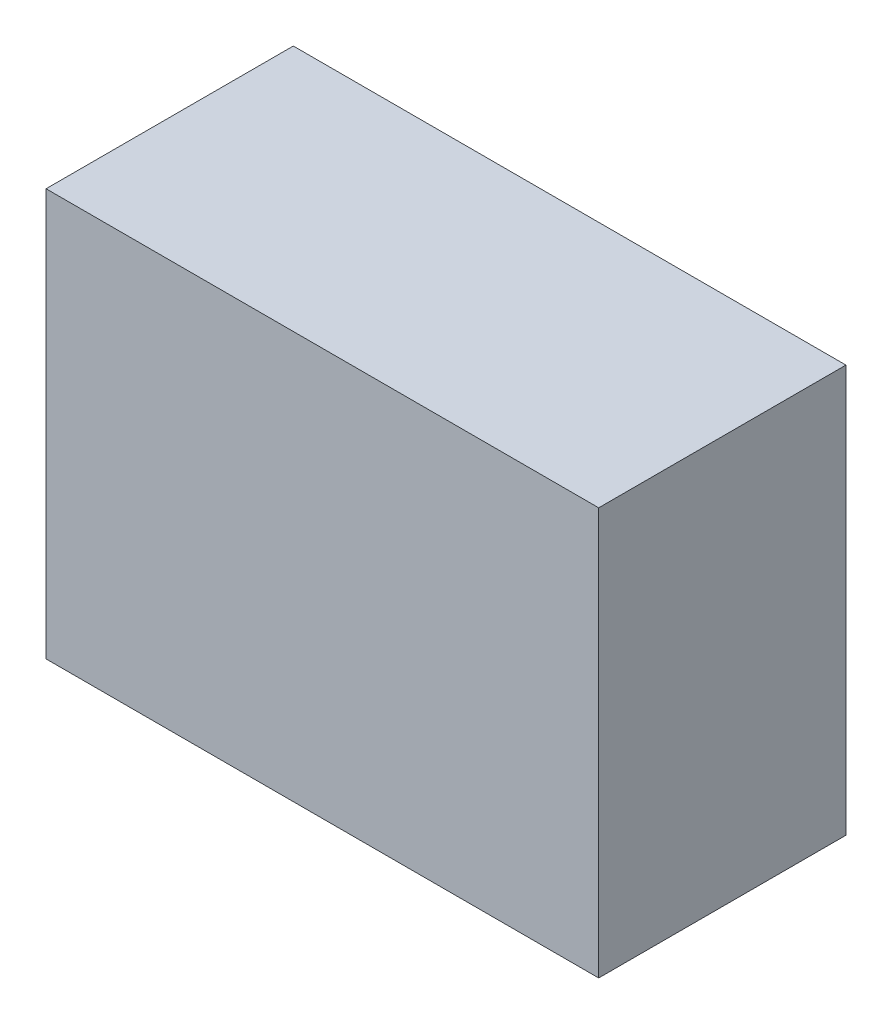
ISO-10303-21;
HEADER;
FILE_DESCRIPTION(('STEP AP214'),'2;1');
FILE_NAME('part.step','',(''),(''),'','','');
FILE_SCHEMA(('AUTOMOTIVE_DESIGN { 1 0 10303 214 1 1 1 1 }'));
ENDSEC;
DATA;
#1=APPLICATION_CONTEXT('core data for automotive mechanical design processes');
#2=APPLICATION_PROTOCOL_DEFINITION('international standard','automotive_design',2000,#1);
#3=PRODUCT_CONTEXT('',#1,'mechanical');
#4=PRODUCT('Part','Part','',(#3));
#5=PRODUCT_RELATED_PRODUCT_CATEGORY('part','',(#4));
#6=PRODUCT_DEFINITION_FORMATION('','',#4);
#7=PRODUCT_DEFINITION_CONTEXT('part definition',#1,'design');
#8=PRODUCT_DEFINITION('design','',#6,#7);
#9=PRODUCT_DEFINITION_SHAPE('','',#8);
#10=(LENGTH_UNIT() NAMED_UNIT(*) SI_UNIT(.MILLI.,.METRE.));
#11=(NAMED_UNIT(*) PLANE_ANGLE_UNIT() SI_UNIT($,.RADIAN.));
#12=(NAMED_UNIT(*) SI_UNIT($,.STERADIAN.) SOLID_ANGLE_UNIT());
#13=UNCERTAINTY_MEASURE_WITH_UNIT(LENGTH_MEASURE(1.E-05),#10,'distance_accuracy_value','');
#14=(GEOMETRIC_REPRESENTATION_CONTEXT(3) GLOBAL_UNCERTAINTY_ASSIGNED_CONTEXT((#13)) GLOBAL_UNIT_ASSIGNED_CONTEXT((#10,
#11,#12)) REPRESENTATION_CONTEXT('',''));
#15=CARTESIAN_POINT('',(0.,0.,0.));
#16=DIRECTION('',(0.,0.,1.));
#17=DIRECTION('',(1.,0.,0.));
#18=AXIS2_PLACEMENT_3D('',#15,#16,#17);
#19=CARTESIAN_POINT('',(-1.9,1.4,1.7));
#20=DIRECTION('',(1.,0.,0.));
#21=DIRECTION('',(0.,1.,0.));
#22=AXIS2_PLACEMENT_3D('',#19,#20,#21);
#23=PLANE('',#22);
#24=DIRECTION('',(0.,-1.,0.));
#25=VECTOR('',#24,1.);
#26=CARTESIAN_POINT('',(-1.9,1.4,0.));
#27=LINE('',#26,#25);
#28=CARTESIAN_POINT('',(-1.9,1.4,0.));
#29=VERTEX_POINT('',#28);
#30=CARTESIAN_POINT('',(-1.9,-1.4,0.));
#31=VERTEX_POINT('',#30);
#32=EDGE_CURVE('E104',#29,#31,#27,.T.);
#33=ORIENTED_EDGE('',*,*,#32,.T.);
#34=DIRECTION('',(0.,0.,-1.));
#35=VECTOR('',#34,1.);
#36=CARTESIAN_POINT('',(-1.9,-1.4,1.7));
#37=LINE('',#36,#35);
#38=CARTESIAN_POINT('',(-1.9,-1.4,1.7));
#39=VERTEX_POINT('',#38);
#40=EDGE_CURVE('E11',#39,#31,#37,.T.);
#41=ORIENTED_EDGE('',*,*,#40,.F.);
#42=DIRECTION('',(0.,-1.,0.));
#43=VECTOR('',#42,1.);
#44=CARTESIAN_POINT('',(-1.9,1.4,1.7));
#45=LINE('',#44,#43);
#46=CARTESIAN_POINT('',(-1.9,1.4,1.7));
#47=VERTEX_POINT('',#46);
#48=EDGE_CURVE('E92',#47,#39,#45,.T.);
#49=ORIENTED_EDGE('',*,*,#48,.F.);
#50=DIRECTION('',(0.,0.,-1.));
#51=VECTOR('',#50,1.);
#52=CARTESIAN_POINT('',(-1.9,1.4,1.7));
#53=LINE('',#52,#51);
#54=EDGE_CURVE('E100',#47,#29,#53,.T.);
#55=ORIENTED_EDGE('',*,*,#54,.T.);
#56=EDGE_LOOP('',(#33,#41,#49,#55));
#57=FACE_BOUND('',#56,.T.);
#58=ADVANCED_FACE('F41',(#57),#23,.F.);
#59=CARTESIAN_POINT('',(-1.9,-1.4,1.7));
#60=DIRECTION('',(0.,1.,0.));
#61=DIRECTION('',(0.,0.,1.));
#62=AXIS2_PLACEMENT_3D('',#59,#60,#61);
#63=PLANE('',#62);
#64=DIRECTION('',(1.,0.,0.));
#65=VECTOR('',#64,1.);
#66=CARTESIAN_POINT('',(-1.9,-1.4,0.));
#67=LINE('',#66,#65);
#68=CARTESIAN_POINT('',(1.9,-1.4,0.));
#69=VERTEX_POINT('',#68);
#70=EDGE_CURVE('E96',#31,#69,#67,.T.);
#71=ORIENTED_EDGE('',*,*,#70,.T.);
#72=DIRECTION('',(0.,0.,-1.));
#73=VECTOR('',#72,1.);
#74=CARTESIAN_POINT('',(1.9,-1.4,1.7));
#75=LINE('',#74,#73);
#76=CARTESIAN_POINT('',(1.9,-1.4,1.7));
#77=VERTEX_POINT('',#76);
#78=EDGE_CURVE('E49',#77,#69,#75,.T.);
#79=ORIENTED_EDGE('',*,*,#78,.F.);
#80=DIRECTION('',(1.,0.,0.));
#81=VECTOR('',#80,1.);
#82=CARTESIAN_POINT('',(-1.9,-1.4,1.7));
#83=LINE('',#82,#81);
#84=EDGE_CURVE('E87',#39,#77,#83,.T.);
#85=ORIENTED_EDGE('',*,*,#84,.F.);
#86=ORIENTED_EDGE('',*,*,#40,.T.);
#87=EDGE_LOOP('',(#71,#79,#85,#86));
#88=FACE_BOUND('',#87,.T.);
#89=ADVANCED_FACE('F95',(#88),#63,.F.);
#90=CARTESIAN_POINT('',(1.9,1.4,1.7));
#91=DIRECTION('',(-1.,0.,0.));
#92=DIRECTION('',(0.,-1.,0.));
#93=AXIS2_PLACEMENT_3D('',#90,#91,#92);
#94=PLANE('',#93);
#95=DIRECTION('',(0.,1.,0.));
#96=VECTOR('',#95,1.);
#97=CARTESIAN_POINT('',(1.9,1.4,0.));
#98=LINE('',#97,#96);
#99=CARTESIAN_POINT('',(1.9,1.4,0.));
#100=VERTEX_POINT('',#99);
#101=EDGE_CURVE('E74',#69,#100,#98,.T.);
#102=ORIENTED_EDGE('',*,*,#101,.T.);
#103=DIRECTION('',(0.,0.,-1.));
#104=VECTOR('',#103,1.);
#105=CARTESIAN_POINT('',(1.9,1.4,1.7));
#106=LINE('',#105,#104);
#107=CARTESIAN_POINT('',(1.9,1.4,1.7));
#108=VERTEX_POINT('',#107);
#109=EDGE_CURVE('E97',#108,#100,#106,.T.);
#110=ORIENTED_EDGE('',*,*,#109,.F.);
#111=DIRECTION('',(0.,1.,0.));
#112=VECTOR('',#111,1.);
#113=CARTESIAN_POINT('',(1.9,1.4,1.7));
#114=LINE('',#113,#112);
#115=EDGE_CURVE('E90',#77,#108,#114,.T.);
#116=ORIENTED_EDGE('',*,*,#115,.F.);
#117=ORIENTED_EDGE('',*,*,#78,.T.);
#118=EDGE_LOOP('',(#102,#110,#116,#117));
#119=FACE_BOUND('',#118,.T.);
#120=ADVANCED_FACE('F98',(#119),#94,.F.);
#121=CARTESIAN_POINT('',(-1.9,1.4,1.7));
#122=DIRECTION('',(0.,-1.,0.));
#123=DIRECTION('',(0.,0.,-1.));
#124=AXIS2_PLACEMENT_3D('',#121,#122,#123);
#125=PLANE('',#124);
#126=DIRECTION('',(-1.,0.,0.));
#127=VECTOR('',#126,1.);
#128=CARTESIAN_POINT('',(-1.9,1.4,0.));
#129=LINE('',#128,#127);
#130=EDGE_CURVE('E80',#100,#29,#129,.T.);
#131=ORIENTED_EDGE('',*,*,#130,.T.);
#132=ORIENTED_EDGE('',*,*,#54,.F.);
#133=DIRECTION('',(-1.,0.,0.));
#134=VECTOR('',#133,1.);
#135=CARTESIAN_POINT('',(-1.9,1.4,1.7));
#136=LINE('',#135,#134);
#137=EDGE_CURVE('E57',#108,#47,#136,.T.);
#138=ORIENTED_EDGE('',*,*,#137,.F.);
#139=ORIENTED_EDGE('',*,*,#109,.T.);
#140=EDGE_LOOP('',(#131,#132,#138,#139));
#141=FACE_BOUND('',#140,.T.);
#142=ADVANCED_FACE('F111',(#141),#125,.F.);
#143=CARTESIAN_POINT('',(0.,0.,1.7));
#144=DIRECTION('',(0.,0.,1.));
#145=DIRECTION('',(1.,0.,0.));
#146=AXIS2_PLACEMENT_3D('',#143,#144,#145);
#147=PLANE('',#146);
#148=ORIENTED_EDGE('',*,*,#48,.T.);
#149=ORIENTED_EDGE('',*,*,#84,.T.);
#150=ORIENTED_EDGE('',*,*,#115,.T.);
#151=ORIENTED_EDGE('',*,*,#137,.T.);
#152=EDGE_LOOP('',(#148,#149,#150,#151));
#153=FACE_BOUND('',#152,.T.);
#154=ADVANCED_FACE('F88',(#153),#147,.T.);
#155=CARTESIAN_POINT('',(0.,0.,0.));
#156=DIRECTION('',(0.,0.,1.));
#157=DIRECTION('',(1.,0.,0.));
#158=AXIS2_PLACEMENT_3D('',#155,#156,#157);
#159=PLANE('',#158);
#160=ORIENTED_EDGE('',*,*,#32,.F.);
#161=ORIENTED_EDGE('',*,*,#130,.F.);
#162=ORIENTED_EDGE('',*,*,#101,.F.);
#163=ORIENTED_EDGE('',*,*,#70,.F.);
#164=EDGE_LOOP('',(#160,#161,#162,#163));
#165=FACE_BOUND('',#164,.T.);
#166=ADVANCED_FACE('F114',(#165),#159,.F.);
#167=CLOSED_SHELL('',(#58,#89,#120,#142,#154,#166));
#168=MANIFOLD_SOLID_BREP('B2',#167);
#169=ADVANCED_BREP_SHAPE_REPRESENTATION('',(#18,#168),#14);
#170=SHAPE_DEFINITION_REPRESENTATION(#9,#169);
ENDSEC;
END-ISO-10303-21;
